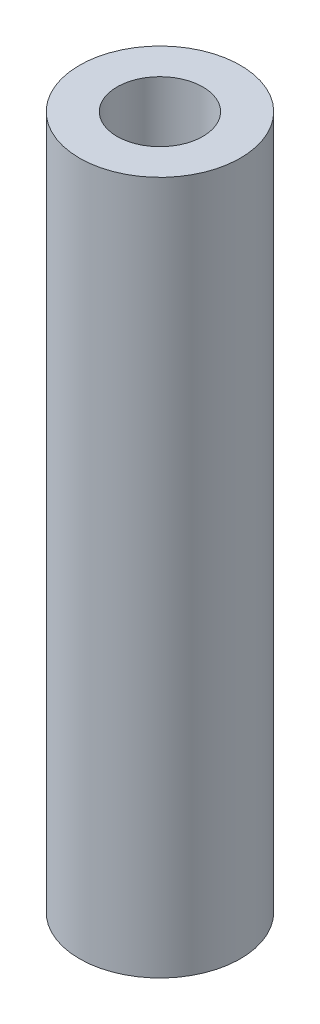
ISO-10303-21;
HEADER;
FILE_DESCRIPTION(('STEP AP214'),'2;1');
FILE_NAME('part.step','',(''),(''),'','','');
FILE_SCHEMA(('AUTOMOTIVE_DESIGN { 1 0 10303 214 1 1 1 1 }'));
ENDSEC;
DATA;
#1=APPLICATION_CONTEXT('core data for automotive mechanical design processes');
#2=APPLICATION_PROTOCOL_DEFINITION('international standard','automotive_design',2000,#1);
#3=PRODUCT_CONTEXT('',#1,'mechanical');
#4=PRODUCT('Part','Part','',(#3));
#5=PRODUCT_RELATED_PRODUCT_CATEGORY('part','',(#4));
#6=PRODUCT_DEFINITION_FORMATION('','',#4);
#7=PRODUCT_DEFINITION_CONTEXT('part definition',#1,'design');
#8=PRODUCT_DEFINITION('design','',#6,#7);
#9=PRODUCT_DEFINITION_SHAPE('','',#8);
#10=(LENGTH_UNIT() NAMED_UNIT(*) SI_UNIT(.MILLI.,.METRE.));
#11=(NAMED_UNIT(*) PLANE_ANGLE_UNIT() SI_UNIT($,.RADIAN.));
#12=(NAMED_UNIT(*) SI_UNIT($,.STERADIAN.) SOLID_ANGLE_UNIT());
#13=UNCERTAINTY_MEASURE_WITH_UNIT(LENGTH_MEASURE(1.E-05),#10,'distance_accuracy_value','');
#14=(GEOMETRIC_REPRESENTATION_CONTEXT(3) GLOBAL_UNCERTAINTY_ASSIGNED_CONTEXT((#13)) GLOBAL_UNIT_ASSIGNED_CONTEXT((#10,
#11,#12)) REPRESENTATION_CONTEXT('',''));
#15=CARTESIAN_POINT('',(0.,0.,0.));
#16=DIRECTION('',(0.,0.,1.));
#17=DIRECTION('',(1.,0.,0.));
#18=AXIS2_PLACEMENT_3D('',#15,#16,#17);
#19=CARTESIAN_POINT('',(0.,25.8572,0.));
#20=DIRECTION('',(0.,1.,0.));
#21=DIRECTION('',(0.,0.,1.));
#22=AXIS2_PLACEMENT_3D('',#19,#20,#21);
#23=PLANE('',#22);
#24=CARTESIAN_POINT('',(0.,25.8572,0.));
#25=DIRECTION('',(0.,1.,0.));
#26=DIRECTION('',(0.,0.,1.));
#27=AXIS2_PLACEMENT_3D('',#24,#25,#26);
#28=CIRCLE('',#27,3.);
#29=CARTESIAN_POINT('',(0.,25.8572,3.));
#30=VERTEX_POINT('',#29);
#31=EDGE_CURVE('E10',#30,#30,#28,.T.);
#32=ORIENTED_EDGE('',*,*,#31,.T.);
#33=EDGE_LOOP('',(#32));
#34=FACE_BOUND('',#33,.T.);
#35=CARTESIAN_POINT('',(0.,25.8572,0.));
#36=DIRECTION('',(0.,1.,0.));
#37=DIRECTION('',(0.,0.,1.));
#38=AXIS2_PLACEMENT_3D('',#35,#36,#37);
#39=CIRCLE('',#38,1.6);
#40=CARTESIAN_POINT('',(0.,25.8572,1.6));
#41=VERTEX_POINT('',#40);
#42=EDGE_CURVE('E42',#41,#41,#39,.T.);
#43=ORIENTED_EDGE('',*,*,#42,.F.);
#44=EDGE_LOOP('',(#43));
#45=FACE_BOUND('',#44,.T.);
#46=ADVANCED_FACE('F31',(#34,#45),#23,.T.);
#47=CARTESIAN_POINT('',(0.,0.,0.));
#48=DIRECTION('',(0.,1.,0.));
#49=DIRECTION('',(0.,0.,1.));
#50=AXIS2_PLACEMENT_3D('',#47,#48,#49);
#51=PLANE('',#50);
#52=CARTESIAN_POINT('',(0.,0.,0.));
#53=DIRECTION('',(0.,1.,0.));
#54=DIRECTION('',(0.,0.,1.));
#55=AXIS2_PLACEMENT_3D('',#52,#53,#54);
#56=CIRCLE('',#55,3.);
#57=CARTESIAN_POINT('',(0.,0.,3.));
#58=VERTEX_POINT('',#57);
#59=EDGE_CURVE('E35',#58,#58,#56,.T.);
#60=ORIENTED_EDGE('',*,*,#59,.F.);
#61=EDGE_LOOP('',(#60));
#62=FACE_BOUND('',#61,.T.);
#63=CARTESIAN_POINT('',(0.,0.,0.));
#64=DIRECTION('',(0.,1.,0.));
#65=DIRECTION('',(0.,0.,1.));
#66=AXIS2_PLACEMENT_3D('',#63,#64,#65);
#67=CIRCLE('',#66,1.6);
#68=CARTESIAN_POINT('',(0.,0.,1.6));
#69=VERTEX_POINT('',#68);
#70=EDGE_CURVE('E44',#69,#69,#67,.T.);
#71=ORIENTED_EDGE('',*,*,#70,.T.);
#72=EDGE_LOOP('',(#71));
#73=FACE_BOUND('',#72,.T.);
#74=ADVANCED_FACE('F54',(#62,#73),#51,.F.);
#75=CARTESIAN_POINT('',(0.,25.8572,0.));
#76=DIRECTION('',(0.,-1.,0.));
#77=DIRECTION('',(0.,0.,-1.));
#78=AXIS2_PLACEMENT_3D('',#75,#76,#77);
#79=CYLINDRICAL_SURFACE('',#78,3.);
#80=ORIENTED_EDGE('',*,*,#31,.F.);
#81=EDGE_LOOP('',(#80));
#82=FACE_BOUND('',#81,.T.);
#83=ORIENTED_EDGE('',*,*,#59,.T.);
#84=EDGE_LOOP('',(#83));
#85=FACE_BOUND('',#84,.T.);
#86=ADVANCED_FACE('F33',(#82,#85),#79,.T.);
#87=CARTESIAN_POINT('',(0.,25.8572,0.));
#88=DIRECTION('',(0.,-1.,0.));
#89=DIRECTION('',(0.,0.,-1.));
#90=AXIS2_PLACEMENT_3D('',#87,#88,#89);
#91=CYLINDRICAL_SURFACE('',#90,1.6);
#92=ORIENTED_EDGE('',*,*,#42,.T.);
#93=EDGE_LOOP('',(#92));
#94=FACE_BOUND('',#93,.T.);
#95=ORIENTED_EDGE('',*,*,#70,.F.);
#96=EDGE_LOOP('',(#95));
#97=FACE_BOUND('',#96,.T.);
#98=ADVANCED_FACE('F50',(#94,#97),#91,.F.);
#99=CLOSED_SHELL('',(#46,#74,#86,#98));
#100=MANIFOLD_SOLID_BREP('B2',#99);
#101=ADVANCED_BREP_SHAPE_REPRESENTATION('',(#18,#100),#14);
#102=SHAPE_DEFINITION_REPRESENTATION(#9,#101);
ENDSEC;
END-ISO-10303-21;
